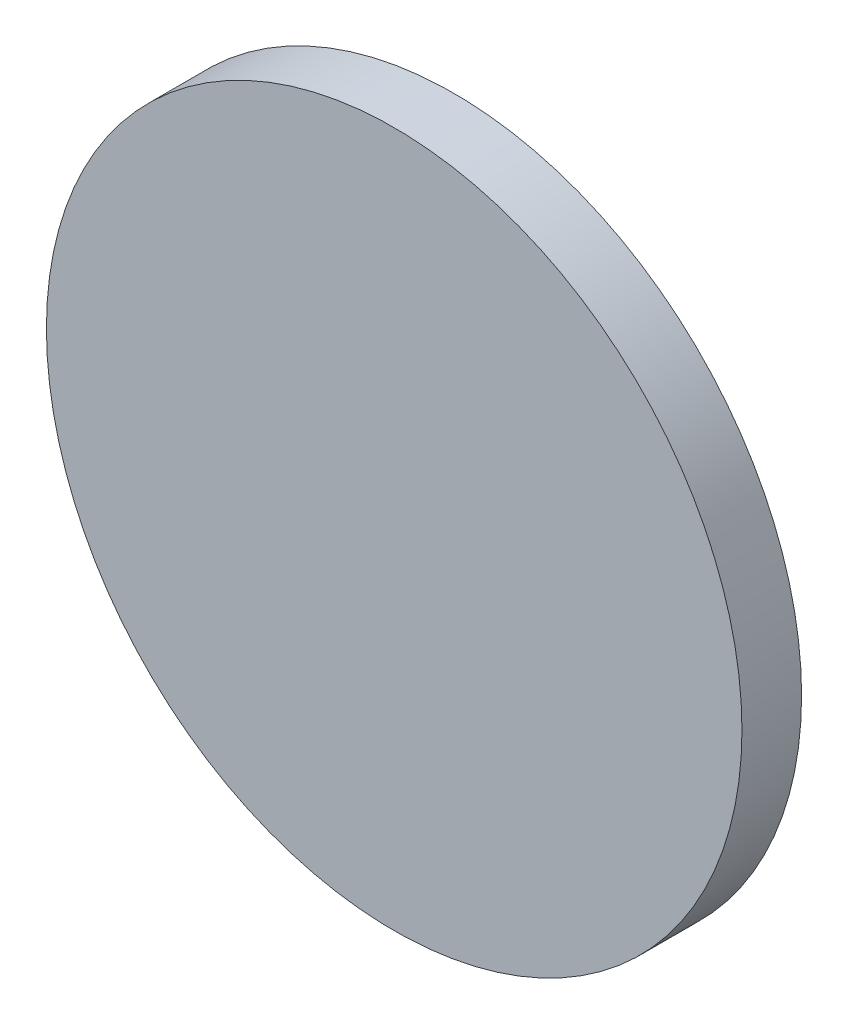
ISO-10303-21;
HEADER;
FILE_DESCRIPTION(('STEP AP214'),'2;1');
FILE_NAME('part.step','',(''),(''),'','','');
FILE_SCHEMA(('AUTOMOTIVE_DESIGN { 1 0 10303 214 1 1 1 1 }'));
ENDSEC;
DATA;
#1=APPLICATION_CONTEXT('core data for automotive mechanical design processes');
#2=APPLICATION_PROTOCOL_DEFINITION('international standard','automotive_design',2000,#1);
#3=PRODUCT_CONTEXT('',#1,'mechanical');
#4=PRODUCT('Part','Part','',(#3));
#5=PRODUCT_RELATED_PRODUCT_CATEGORY('part','',(#4));
#6=PRODUCT_DEFINITION_FORMATION('','',#4);
#7=PRODUCT_DEFINITION_CONTEXT('part definition',#1,'design');
#8=PRODUCT_DEFINITION('design','',#6,#7);
#9=PRODUCT_DEFINITION_SHAPE('','',#8);
#10=(LENGTH_UNIT() NAMED_UNIT(*) SI_UNIT(.MILLI.,.METRE.));
#11=(NAMED_UNIT(*) PLANE_ANGLE_UNIT() SI_UNIT($,.RADIAN.));
#12=(NAMED_UNIT(*) SI_UNIT($,.STERADIAN.) SOLID_ANGLE_UNIT());
#13=UNCERTAINTY_MEASURE_WITH_UNIT(LENGTH_MEASURE(1.E-05),#10,'distance_accuracy_value','');
#14=(GEOMETRIC_REPRESENTATION_CONTEXT(3) GLOBAL_UNCERTAINTY_ASSIGNED_CONTEXT((#13)) GLOBAL_UNIT_ASSIGNED_CONTEXT((#10,
#11,#12)) REPRESENTATION_CONTEXT('',''));
#15=CARTESIAN_POINT('',(0.,0.,0.));
#16=DIRECTION('',(0.,0.,1.));
#17=DIRECTION('',(1.,0.,0.));
#18=AXIS2_PLACEMENT_3D('',#15,#16,#17);
#19=CARTESIAN_POINT('',(5.739,6.5,0.76487));
#20=DIRECTION('',(0.,0.,-1.));
#21=DIRECTION('',(-1.,0.,0.));
#22=AXIS2_PLACEMENT_3D('',#19,#20,#21);
#23=PLANE('',#22);
#24=CARTESIAN_POINT('',(5.739,6.5,0.76487));
#25=DIRECTION('',(0.,0.,1.));
#26=DIRECTION('',(1.,0.,0.));
#27=AXIS2_PLACEMENT_3D('',#24,#25,#26);
#28=CIRCLE('',#27,0.200024667);
#29=CARTESIAN_POINT('',(5.939024667,6.5,0.76487));
#30=VERTEX_POINT('',#29);
#31=EDGE_CURVE('E18',#30,#30,#28,.T.);
#32=ORIENTED_EDGE('',*,*,#31,.F.);
#33=EDGE_LOOP('',(#32));
#34=FACE_BOUND('',#33,.T.);
#35=ADVANCED_FACE('F15',(#34),#23,.T.);
#36=CARTESIAN_POINT('',(5.739,6.5,0.76487));
#37=DIRECTION('',(0.,0.,1.));
#38=DIRECTION('',(1.,0.,0.));
#39=AXIS2_PLACEMENT_3D('',#36,#37,#38);
#40=CYLINDRICAL_SURFACE('',#39,0.200024667);
#41=CARTESIAN_POINT('',(5.739,6.5,0.79916));
#42=DIRECTION('',(0.,0.,1.));
#43=DIRECTION('',(1.,0.,0.));
#44=AXIS2_PLACEMENT_3D('',#41,#42,#43);
#45=CIRCLE('',#44,0.200024667);
#46=CARTESIAN_POINT('',(5.939024667,6.5,0.79916));
#47=VERTEX_POINT('',#46);
#48=EDGE_CURVE('E10',#47,#47,#45,.T.);
#49=ORIENTED_EDGE('',*,*,#48,.F.);
#50=EDGE_LOOP('',(#49));
#51=FACE_BOUND('',#50,.T.);
#52=ORIENTED_EDGE('',*,*,#31,.T.);
#53=EDGE_LOOP('',(#52));
#54=FACE_BOUND('',#53,.T.);
#55=ADVANCED_FACE('F27',(#51,#54),#40,.T.);
#56=CARTESIAN_POINT('',(5.739,6.5,0.79916));
#57=DIRECTION('',(0.,0.,1.));
#58=DIRECTION('',(1.,0.,0.));
#59=AXIS2_PLACEMENT_3D('',#56,#57,#58);
#60=PLANE('',#59);
#61=ORIENTED_EDGE('',*,*,#48,.T.);
#62=EDGE_LOOP('',(#61));
#63=FACE_BOUND('',#62,.T.);
#64=ADVANCED_FACE('F34',(#63),#60,.T.);
#65=CLOSED_SHELL('',(#35,#55,#64));
#66=MANIFOLD_SOLID_BREP('B1',#65);
#67=ADVANCED_BREP_SHAPE_REPRESENTATION('',(#18,#66),#14);
#68=SHAPE_DEFINITION_REPRESENTATION(#9,#67);
ENDSEC;
END-ISO-10303-21;
